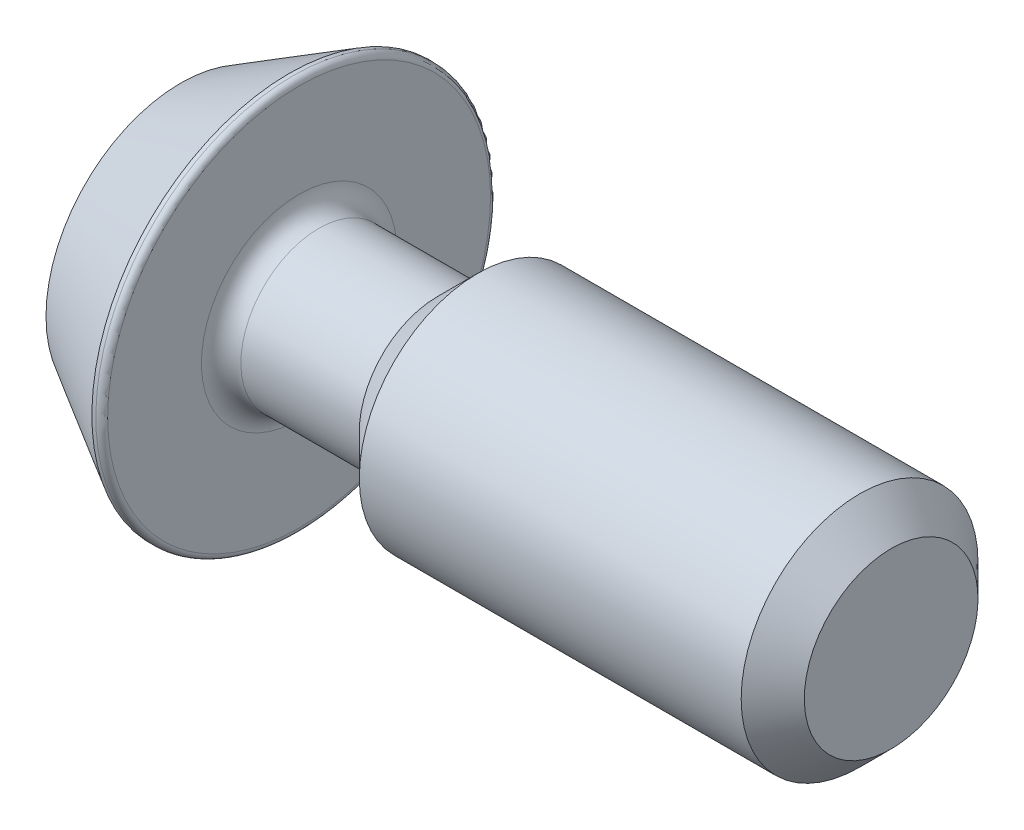
ISO-10303-21;
HEADER;
FILE_DESCRIPTION(('STEP AP214'),'2;1');
FILE_NAME('part.step','',(''),(''),'','','');
FILE_SCHEMA(('AUTOMOTIVE_DESIGN { 1 0 10303 214 1 1 1 1 }'));
ENDSEC;
DATA;
#1=APPLICATION_CONTEXT('core data for automotive mechanical design processes');
#2=APPLICATION_PROTOCOL_DEFINITION('international standard','automotive_design',2000,#1);
#3=PRODUCT_CONTEXT('',#1,'mechanical');
#4=PRODUCT('Part','Part','',(#3));
#5=PRODUCT_RELATED_PRODUCT_CATEGORY('part','',(#4));
#6=PRODUCT_DEFINITION_FORMATION('','',#4);
#7=PRODUCT_DEFINITION_CONTEXT('part definition',#1,'design');
#8=PRODUCT_DEFINITION('design','',#6,#7);
#9=PRODUCT_DEFINITION_SHAPE('','',#8);
#10=(LENGTH_UNIT() NAMED_UNIT(*) SI_UNIT(.MILLI.,.METRE.));
#11=(NAMED_UNIT(*) PLANE_ANGLE_UNIT() SI_UNIT($,.RADIAN.));
#12=(NAMED_UNIT(*) SI_UNIT($,.STERADIAN.) SOLID_ANGLE_UNIT());
#13=UNCERTAINTY_MEASURE_WITH_UNIT(LENGTH_MEASURE(1.E-05),#10,'distance_accuracy_value','');
#14=(GEOMETRIC_REPRESENTATION_CONTEXT(3) GLOBAL_UNCERTAINTY_ASSIGNED_CONTEXT((#13)) GLOBAL_UNIT_ASSIGNED_CONTEXT((#10,
#11,#12)) REPRESENTATION_CONTEXT('',''));
#15=CARTESIAN_POINT('',(0.,0.,0.));
#16=DIRECTION('',(0.,0.,1.));
#17=DIRECTION('',(1.,0.,0.));
#18=AXIS2_PLACEMENT_3D('',#15,#16,#17);
#19=CARTESIAN_POINT('',(0.,0.,0.));
#20=DIRECTION('',(-1.,0.,0.));
#21=DIRECTION('',(0.,-1.,0.));
#22=AXIS2_PLACEMENT_3D('',#19,#20,#21);
#23=PLANE('',#22);
#24=DIRECTION('',(0.,0.866025403784438,-0.5));
#25=VECTOR('',#24,1.);
#26=CARTESIAN_POINT('',(0.,0.,3.46410161513775));
#27=LINE('',#26,#25);
#28=CARTESIAN_POINT('',(0.,0.,3.46410161513775));
#29=VERTEX_POINT('',#28);
#30=CARTESIAN_POINT('',(0.,3.,1.73205080756888));
#31=VERTEX_POINT('',#30);
#32=EDGE_CURVE('E53',#29,#31,#27,.T.);
#33=ORIENTED_EDGE('',*,*,#32,.F.);
#34=DIRECTION('',(0.,0.866025403784438,0.5));
#35=VECTOR('',#34,1.);
#36=CARTESIAN_POINT('',(0.,-3.,1.73205080756888));
#37=LINE('',#36,#35);
#38=CARTESIAN_POINT('',(0.,-3.,1.73205080756888));
#39=VERTEX_POINT('',#38);
#40=EDGE_CURVE('E136',#39,#29,#37,.T.);
#41=ORIENTED_EDGE('',*,*,#40,.F.);
#42=DIRECTION('',(0.,0.,1.));
#43=VECTOR('',#42,1.);
#44=CARTESIAN_POINT('',(0.,-3.,-1.73205080756888));
#45=LINE('',#44,#43);
#46=CARTESIAN_POINT('',(0.,-3.,-1.73205080756888));
#47=VERTEX_POINT('',#46);
#48=EDGE_CURVE('E134',#47,#39,#45,.T.);
#49=ORIENTED_EDGE('',*,*,#48,.F.);
#50=DIRECTION('',(0.,-0.866025403784438,0.5));
#51=VECTOR('',#50,1.);
#52=CARTESIAN_POINT('',(0.,0.,-3.46410161513775));
#53=LINE('',#52,#51);
#54=CARTESIAN_POINT('',(0.,0.,-3.46410161513775));
#55=VERTEX_POINT('',#54);
#56=EDGE_CURVE('E101',#55,#47,#53,.T.);
#57=ORIENTED_EDGE('',*,*,#56,.F.);
#58=DIRECTION('',(0.,-0.866025403784439,-0.5));
#59=VECTOR('',#58,1.);
#60=CARTESIAN_POINT('',(0.,3.,-1.73205080756888));
#61=LINE('',#60,#59);
#62=CARTESIAN_POINT('',(0.,3.,-1.73205080756888));
#63=VERTEX_POINT('',#62);
#64=EDGE_CURVE('E130',#63,#55,#61,.T.);
#65=ORIENTED_EDGE('',*,*,#64,.F.);
#66=DIRECTION('',(0.,0.,-1.));
#67=VECTOR('',#66,1.);
#68=CARTESIAN_POINT('',(0.,3.,1.73205080756888));
#69=LINE('',#68,#67);
#70=EDGE_CURVE('E127',#31,#63,#69,.T.);
#71=ORIENTED_EDGE('',*,*,#70,.F.);
#72=EDGE_LOOP('',(#33,#41,#49,#57,#65,#71));
#73=FACE_BOUND('',#72,.T.);
#74=CARTESIAN_POINT('',(0.,0.,0.));
#75=DIRECTION('',(1.,0.,0.));
#76=DIRECTION('',(0.,1.,0.));
#77=AXIS2_PLACEMENT_3D('',#74,#75,#76);
#78=CIRCLE('',#77,6.82457351945704);
#79=CARTESIAN_POINT('',(0.,6.82457351945704,0.));
#80=VERTEX_POINT('',#79);
#81=EDGE_CURVE('E154',#80,#80,#78,.T.);
#82=ORIENTED_EDGE('',*,*,#81,.F.);
#83=EDGE_LOOP('',(#82));
#84=FACE_BOUND('',#83,.T.);
#85=ADVANCED_FACE('F38',(#73,#84),#23,.T.);
#86=CARTESIAN_POINT('',(5.5,0.,0.));
#87=DIRECTION('',(1.,0.,0.));
#88=DIRECTION('',(0.,1.,0.));
#89=AXIS2_PLACEMENT_3D('',#86,#87,#88);
#90=CONICAL_SURFACE('',#89,9.99999999999999,0.5235987755983);
#91=ORIENTED_EDGE('',*,*,#81,.T.);
#92=EDGE_LOOP('',(#91));
#93=FACE_BOUND('',#92,.T.);
#94=CARTESIAN_POINT('',(5.5,0.,0.));
#95=DIRECTION('',(1.,0.,0.));
#96=DIRECTION('',(0.,1.,0.));
#97=AXIS2_PLACEMENT_3D('',#94,#95,#96);
#98=CIRCLE('',#97,9.99999999999999);
#99=CARTESIAN_POINT('',(5.5,10.,0.));
#100=VERTEX_POINT('',#99);
#101=EDGE_CURVE('E151',#100,#100,#98,.T.);
#102=ORIENTED_EDGE('',*,*,#101,.F.);
#103=EDGE_LOOP('',(#102));
#104=FACE_BOUND('',#103,.T.);
#105=ADVANCED_FACE('F184',(#93,#104),#90,.T.);
#106=CARTESIAN_POINT('',(36.,0.,0.));
#107=DIRECTION('',(1.,0.,0.));
#108=DIRECTION('',(0.,1.,0.));
#109=AXIS2_PLACEMENT_3D('',#106,#107,#108);
#110=CYLINDRICAL_SURFACE('',#109,9.99999999999999);
#111=CARTESIAN_POINT('',(5.7,0.,0.));
#112=DIRECTION('',(1.,0.,0.));
#113=DIRECTION('',(0.,1.,0.));
#114=AXIS2_PLACEMENT_3D('',#111,#112,#113);
#115=CIRCLE('',#114,9.99999999999999);
#116=CARTESIAN_POINT('',(5.69999999999999,10.,0.));
#117=VERTEX_POINT('',#116);
#118=EDGE_CURVE('E160',#117,#117,#115,.F.);
#119=ORIENTED_EDGE('',*,*,#118,.T.);
#120=EDGE_LOOP('',(#119));
#121=FACE_BOUND('',#120,.T.);
#122=ORIENTED_EDGE('',*,*,#101,.T.);
#123=EDGE_LOOP('',(#122));
#124=FACE_BOUND('',#123,.T.);
#125=ADVANCED_FACE('F190',(#121,#124),#110,.T.);
#126=CARTESIAN_POINT('',(6.,10.,0.));
#127=DIRECTION('',(1.,0.,0.));
#128=DIRECTION('',(0.,1.,0.));
#129=AXIS2_PLACEMENT_3D('',#126,#127,#128);
#130=PLANE('',#129);
#131=CARTESIAN_POINT('',(6.,0.,0.));
#132=DIRECTION('',(1.,0.,0.));
#133=DIRECTION('',(0.,1.,0.));
#134=AXIS2_PLACEMENT_3D('',#131,#132,#133);
#135=CIRCLE('',#134,4.95);
#136=CARTESIAN_POINT('',(6.,4.95,0.));
#137=VERTEX_POINT('',#136);
#138=EDGE_CURVE('E11',#137,#137,#135,.F.);
#139=ORIENTED_EDGE('',*,*,#138,.T.);
#140=EDGE_LOOP('',(#139));
#141=FACE_BOUND('',#140,.T.);
#142=CARTESIAN_POINT('',(6.,0.,0.));
#143=DIRECTION('',(1.,0.,0.));
#144=DIRECTION('',(0.,1.,0.));
#145=AXIS2_PLACEMENT_3D('',#142,#143,#144);
#146=CIRCLE('',#145,9.7);
#147=CARTESIAN_POINT('',(6.,9.7,0.));
#148=VERTEX_POINT('',#147);
#149=EDGE_CURVE('E157',#148,#148,#146,.T.);
#150=ORIENTED_EDGE('',*,*,#149,.T.);
#151=EDGE_LOOP('',(#150));
#152=FACE_BOUND('',#151,.T.);
#153=ADVANCED_FACE('F210',(#141,#152),#130,.T.);
#154=CARTESIAN_POINT('',(36.,0.,0.));
#155=DIRECTION('',(1.,0.,0.));
#156=DIRECTION('',(0.,1.,0.));
#157=AXIS2_PLACEMENT_3D('',#154,#155,#156);
#158=CYLINDRICAL_SURFACE('',#157,3.95);
#159=CARTESIAN_POINT('',(7.,0.,0.));
#160=DIRECTION('',(1.,0.,0.));
#161=DIRECTION('',(0.,1.,0.));
#162=AXIS2_PLACEMENT_3D('',#159,#160,#161);
#163=CIRCLE('',#162,3.95);
#164=CARTESIAN_POINT('',(7.,3.95,0.));
#165=VERTEX_POINT('',#164);
#166=EDGE_CURVE('E46',#165,#165,#163,.T.);
#167=ORIENTED_EDGE('',*,*,#166,.T.);
#168=EDGE_LOOP('',(#167));
#169=FACE_BOUND('',#168,.T.);
#170=CARTESIAN_POINT('',(13.,0.,0.));
#171=DIRECTION('',(1.,0.,0.));
#172=DIRECTION('',(0.,1.,0.));
#173=AXIS2_PLACEMENT_3D('',#170,#171,#172);
#174=CIRCLE('',#173,3.95);
#175=CARTESIAN_POINT('',(13.,3.95,0.));
#176=VERTEX_POINT('',#175);
#177=EDGE_CURVE('E148',#176,#176,#174,.T.);
#178=ORIENTED_EDGE('',*,*,#177,.F.);
#179=EDGE_LOOP('',(#178));
#180=FACE_BOUND('',#179,.T.);
#181=ADVANCED_FACE('F171',(#169,#180),#158,.T.);
#182=CARTESIAN_POINT('',(15.05,0.,0.));
#183=DIRECTION('',(1.,0.,0.));
#184=DIRECTION('',(0.,1.,0.));
#185=AXIS2_PLACEMENT_3D('',#182,#183,#184);
#186=CONICAL_SURFACE('',#185,5.99999999999999,0.78539816339745);
#187=ORIENTED_EDGE('',*,*,#177,.T.);
#188=EDGE_LOOP('',(#187));
#189=FACE_BOUND('',#188,.T.);
#190=CARTESIAN_POINT('',(15.05,0.,0.));
#191=DIRECTION('',(1.,0.,0.));
#192=DIRECTION('',(0.,1.,0.));
#193=AXIS2_PLACEMENT_3D('',#190,#191,#192);
#194=CIRCLE('',#193,5.99999999999999);
#195=CARTESIAN_POINT('',(15.05,6.,0.));
#196=VERTEX_POINT('',#195);
#197=EDGE_CURVE('E140',#196,#196,#194,.T.);
#198=ORIENTED_EDGE('',*,*,#197,.F.);
#199=EDGE_LOOP('',(#198));
#200=FACE_BOUND('',#199,.T.);
#201=ADVANCED_FACE('F218',(#189,#200),#186,.T.);
#202=CARTESIAN_POINT('',(36.,0.,0.));
#203=DIRECTION('',(1.,0.,0.));
#204=DIRECTION('',(0.,1.,0.));
#205=AXIS2_PLACEMENT_3D('',#202,#203,#204);
#206=CYLINDRICAL_SURFACE('',#205,5.99999999999999);
#207=CARTESIAN_POINT('',(34.4,0.,0.));
#208=DIRECTION('',(1.,0.,0.));
#209=DIRECTION('',(0.,1.,0.));
#210=AXIS2_PLACEMENT_3D('',#207,#208,#209);
#211=CIRCLE('',#210,5.99999999999999);
#212=CARTESIAN_POINT('',(34.4,6.,0.));
#213=VERTEX_POINT('',#212);
#214=EDGE_CURVE('E166',#213,#213,#211,.F.);
#215=ORIENTED_EDGE('',*,*,#214,.T.);
#216=EDGE_LOOP('',(#215));
#217=FACE_BOUND('',#216,.T.);
#218=ORIENTED_EDGE('',*,*,#197,.T.);
#219=EDGE_LOOP('',(#218));
#220=FACE_BOUND('',#219,.T.);
#221=ADVANCED_FACE('F224',(#217,#220),#206,.T.);
#222=CARTESIAN_POINT('',(36.,6.,0.));
#223=DIRECTION('',(1.,0.,0.));
#224=DIRECTION('',(0.,1.,0.));
#225=AXIS2_PLACEMENT_3D('',#222,#223,#224);
#226=PLANE('',#225);
#227=CARTESIAN_POINT('',(36.,0.,0.));
#228=DIRECTION('',(1.,0.,0.));
#229=DIRECTION('',(0.,1.,0.));
#230=AXIS2_PLACEMENT_3D('',#227,#228,#229);
#231=CIRCLE('',#230,4.4);
#232=CARTESIAN_POINT('',(36.,4.40000000000001,0.));
#233=VERTEX_POINT('',#232);
#234=EDGE_CURVE('E163',#233,#233,#231,.T.);
#235=ORIENTED_EDGE('',*,*,#234,.T.);
#236=EDGE_LOOP('',(#235));
#237=FACE_BOUND('',#236,.T.);
#238=ADVANCED_FACE('F228',(#237),#226,.T.);
#239=CARTESIAN_POINT('',(4.,0.,3.46410161513775));
#240=DIRECTION('',(0.,0.5,0.866025403784438));
#241=DIRECTION('',(0.,-0.866025403784439,0.5));
#242=AXIS2_PLACEMENT_3D('',#239,#240,#241);
#243=PLANE('',#242);
#244=ORIENTED_EDGE('',*,*,#32,.T.);
#245=DIRECTION('',(-1.,0.,0.));
#246=VECTOR('',#245,1.);
#247=CARTESIAN_POINT('',(4.,3.,1.73205080756888));
#248=LINE('',#247,#246);
#249=CARTESIAN_POINT('',(4.,3.,1.73205080756888));
#250=VERTEX_POINT('',#249);
#251=EDGE_CURVE('E83',#250,#31,#248,.T.);
#252=ORIENTED_EDGE('',*,*,#251,.F.);
#253=DIRECTION('',(0.,0.866025403784438,-0.5));
#254=VECTOR('',#253,1.);
#255=CARTESIAN_POINT('',(4.,0.,3.46410161513775));
#256=LINE('',#255,#254);
#257=CARTESIAN_POINT('',(4.,0.,3.46410161513775));
#258=VERTEX_POINT('',#257);
#259=EDGE_CURVE('E138',#258,#250,#256,.T.);
#260=ORIENTED_EDGE('',*,*,#259,.F.);
#261=DIRECTION('',(-1.,0.,0.));
#262=VECTOR('',#261,1.);
#263=CARTESIAN_POINT('',(4.,0.,3.46410161513775));
#264=LINE('',#263,#262);
#265=EDGE_CURVE('E61',#258,#29,#264,.T.);
#266=ORIENTED_EDGE('',*,*,#265,.T.);
#267=EDGE_LOOP('',(#244,#252,#260,#266));
#268=FACE_BOUND('',#267,.T.);
#269=ADVANCED_FACE('F232',(#268),#243,.F.);
#270=CARTESIAN_POINT('',(4.,-3.,1.73205080756888));
#271=DIRECTION('',(0.,-0.5,0.866025403784439));
#272=DIRECTION('',(0.,-0.866025403784438,-0.5));
#273=AXIS2_PLACEMENT_3D('',#270,#271,#272);
#274=PLANE('',#273);
#275=ORIENTED_EDGE('',*,*,#40,.T.);
#276=ORIENTED_EDGE('',*,*,#265,.F.);
#277=DIRECTION('',(0.,0.866025403784438,0.5));
#278=VECTOR('',#277,1.);
#279=CARTESIAN_POINT('',(4.,-3.,1.73205080756888));
#280=LINE('',#279,#278);
#281=CARTESIAN_POINT('',(4.,-3.,1.73205080756888));
#282=VERTEX_POINT('',#281);
#283=EDGE_CURVE('E113',#282,#258,#280,.T.);
#284=ORIENTED_EDGE('',*,*,#283,.F.);
#285=DIRECTION('',(-1.,0.,0.));
#286=VECTOR('',#285,1.);
#287=CARTESIAN_POINT('',(4.,-3.,1.73205080756888));
#288=LINE('',#287,#286);
#289=EDGE_CURVE('E105',#282,#39,#288,.T.);
#290=ORIENTED_EDGE('',*,*,#289,.T.);
#291=EDGE_LOOP('',(#275,#276,#284,#290));
#292=FACE_BOUND('',#291,.T.);
#293=ADVANCED_FACE('F236',(#292),#274,.F.);
#294=CARTESIAN_POINT('',(4.,-3.,-1.73205080756888));
#295=DIRECTION('',(0.,-1.,0.));
#296=DIRECTION('',(0.,0.,-1.));
#297=AXIS2_PLACEMENT_3D('',#294,#295,#296);
#298=PLANE('',#297);
#299=ORIENTED_EDGE('',*,*,#48,.T.);
#300=ORIENTED_EDGE('',*,*,#289,.F.);
#301=DIRECTION('',(0.,0.,1.));
#302=VECTOR('',#301,1.);
#303=CARTESIAN_POINT('',(4.,-3.,-1.73205080756888));
#304=LINE('',#303,#302);
#305=CARTESIAN_POINT('',(4.,-3.,-1.73205080756888));
#306=VERTEX_POINT('',#305);
#307=EDGE_CURVE('E109',#306,#282,#304,.T.);
#308=ORIENTED_EDGE('',*,*,#307,.F.);
#309=DIRECTION('',(-1.,0.,0.));
#310=VECTOR('',#309,1.);
#311=CARTESIAN_POINT('',(4.,-3.,-1.73205080756888));
#312=LINE('',#311,#310);
#313=EDGE_CURVE('E94',#306,#47,#312,.T.);
#314=ORIENTED_EDGE('',*,*,#313,.T.);
#315=EDGE_LOOP('',(#299,#300,#308,#314));
#316=FACE_BOUND('',#315,.T.);
#317=ADVANCED_FACE('F110',(#316),#298,.F.);
#318=CARTESIAN_POINT('',(4.,0.,-3.46410161513775));
#319=DIRECTION('',(0.,-0.5,-0.866025403784438));
#320=DIRECTION('',(0.,0.866025403784439,-0.5));
#321=AXIS2_PLACEMENT_3D('',#318,#319,#320);
#322=PLANE('',#321);
#323=ORIENTED_EDGE('',*,*,#56,.T.);
#324=ORIENTED_EDGE('',*,*,#313,.F.);
#325=DIRECTION('',(0.,-0.866025403784438,0.5));
#326=VECTOR('',#325,1.);
#327=CARTESIAN_POINT('',(4.,0.,-3.46410161513775));
#328=LINE('',#327,#326);
#329=CARTESIAN_POINT('',(4.,0.,-3.46410161513775));
#330=VERTEX_POINT('',#329);
#331=EDGE_CURVE('E98',#330,#306,#328,.T.);
#332=ORIENTED_EDGE('',*,*,#331,.F.);
#333=DIRECTION('',(-1.,0.,0.));
#334=VECTOR('',#333,1.);
#335=CARTESIAN_POINT('',(4.,0.,-3.46410161513775));
#336=LINE('',#335,#334);
#337=EDGE_CURVE('E106',#330,#55,#336,.T.);
#338=ORIENTED_EDGE('',*,*,#337,.T.);
#339=EDGE_LOOP('',(#323,#324,#332,#338));
#340=FACE_BOUND('',#339,.T.);
#341=ADVANCED_FACE('F96',(#340),#322,.F.);
#342=CARTESIAN_POINT('',(4.,3.,-1.73205080756888));
#343=DIRECTION('',(0.,0.5,-0.866025403784439));
#344=DIRECTION('',(0.,0.866025403784439,0.5));
#345=AXIS2_PLACEMENT_3D('',#342,#343,#344);
#346=PLANE('',#345);
#347=ORIENTED_EDGE('',*,*,#64,.T.);
#348=ORIENTED_EDGE('',*,*,#337,.F.);
#349=DIRECTION('',(0.,-0.866025403784439,-0.5));
#350=VECTOR('',#349,1.);
#351=CARTESIAN_POINT('',(4.,3.,-1.73205080756888));
#352=LINE('',#351,#350);
#353=CARTESIAN_POINT('',(4.,3.,-1.73205080756888));
#354=VERTEX_POINT('',#353);
#355=EDGE_CURVE('E119',#354,#330,#352,.T.);
#356=ORIENTED_EDGE('',*,*,#355,.F.);
#357=DIRECTION('',(-1.,0.,0.));
#358=VECTOR('',#357,1.);
#359=CARTESIAN_POINT('',(4.,3.,-1.73205080756888));
#360=LINE('',#359,#358);
#361=EDGE_CURVE('E143',#354,#63,#360,.T.);
#362=ORIENTED_EDGE('',*,*,#361,.T.);
#363=EDGE_LOOP('',(#347,#348,#356,#362));
#364=FACE_BOUND('',#363,.T.);
#365=ADVANCED_FACE('F239',(#364),#346,.F.);
#366=CARTESIAN_POINT('',(4.,3.,1.73205080756888));
#367=DIRECTION('',(0.,1.,0.));
#368=DIRECTION('',(0.,0.,1.));
#369=AXIS2_PLACEMENT_3D('',#366,#367,#368);
#370=PLANE('',#369);
#371=ORIENTED_EDGE('',*,*,#70,.T.);
#372=ORIENTED_EDGE('',*,*,#361,.F.);
#373=DIRECTION('',(0.,0.,-1.));
#374=VECTOR('',#373,1.);
#375=CARTESIAN_POINT('',(4.,3.,1.73205080756888));
#376=LINE('',#375,#374);
#377=EDGE_CURVE('E121',#250,#354,#376,.T.);
#378=ORIENTED_EDGE('',*,*,#377,.F.);
#379=ORIENTED_EDGE('',*,*,#251,.T.);
#380=EDGE_LOOP('',(#371,#372,#378,#379));
#381=FACE_BOUND('',#380,.T.);
#382=ADVANCED_FACE('F204',(#381),#370,.F.);
#383=CARTESIAN_POINT('',(4.,0.,0.));
#384=DIRECTION('',(-1.,0.,0.));
#385=DIRECTION('',(0.,0.,1.));
#386=AXIS2_PLACEMENT_3D('',#383,#384,#385);
#387=PLANE('',#386);
#388=ORIENTED_EDGE('',*,*,#259,.T.);
#389=ORIENTED_EDGE('',*,*,#377,.T.);
#390=ORIENTED_EDGE('',*,*,#355,.T.);
#391=ORIENTED_EDGE('',*,*,#331,.T.);
#392=ORIENTED_EDGE('',*,*,#307,.T.);
#393=ORIENTED_EDGE('',*,*,#283,.T.);
#394=EDGE_LOOP('',(#388,#389,#390,#391,#392,#393));
#395=FACE_BOUND('',#394,.T.);
#396=ADVANCED_FACE('F116',(#395),#387,.T.);
#397=CARTESIAN_POINT('',(5.7,0.,0.));
#398=DIRECTION('',(1.,0.,0.));
#399=DIRECTION('',(0.,1.,0.));
#400=AXIS2_PLACEMENT_3D('',#397,#398,#399);
#401=TOROIDAL_SURFACE('',#400,9.7,0.3);
#402=ORIENTED_EDGE('',*,*,#118,.F.);
#403=EDGE_LOOP('',(#402));
#404=FACE_BOUND('',#403,.T.);
#405=ORIENTED_EDGE('',*,*,#149,.F.);
#406=EDGE_LOOP('',(#405));
#407=FACE_BOUND('',#406,.T.);
#408=ADVANCED_FACE('F180',(#404,#407),#401,.T.);
#409=CARTESIAN_POINT('',(36.,0.,0.));
#410=DIRECTION('',(-1.,0.,0.));
#411=DIRECTION('',(0.,-1.,0.));
#412=AXIS2_PLACEMENT_3D('',#409,#410,#411);
#413=CONICAL_SURFACE('',#412,4.4,0.785398163397447);
#414=ORIENTED_EDGE('',*,*,#214,.F.);
#415=EDGE_LOOP('',(#414));
#416=FACE_BOUND('',#415,.T.);
#417=ORIENTED_EDGE('',*,*,#234,.F.);
#418=EDGE_LOOP('',(#417));
#419=FACE_BOUND('',#418,.T.);
#420=ADVANCED_FACE('F175',(#416,#419),#413,.T.);
#421=CARTESIAN_POINT('',(7.,0.,0.));
#422=DIRECTION('',(1.,0.,0.));
#423=DIRECTION('',(0.,1.,0.));
#424=AXIS2_PLACEMENT_3D('',#421,#422,#423);
#425=TOROIDAL_SURFACE('',#424,4.95,1.);
#426=ORIENTED_EDGE('',*,*,#138,.F.);
#427=EDGE_LOOP('',(#426));
#428=FACE_BOUND('',#427,.T.);
#429=ORIENTED_EDGE('',*,*,#166,.F.);
#430=EDGE_LOOP('',(#429));
#431=FACE_BOUND('',#430,.T.);
#432=ADVANCED_FACE('F40',(#428,#431),#425,.F.);
#433=CLOSED_SHELL('',(#85,#105,#125,#153,#181,#201,#221,#238,#269,#293,#317,#341,#365,#382,#396,
#408,#420,#432));
#434=MANIFOLD_SOLID_BREP('B2',#433);
#435=ADVANCED_BREP_SHAPE_REPRESENTATION('',(#18,#434),#14);
#436=SHAPE_DEFINITION_REPRESENTATION(#9,#435);
ENDSEC;
END-ISO-10303-21;
